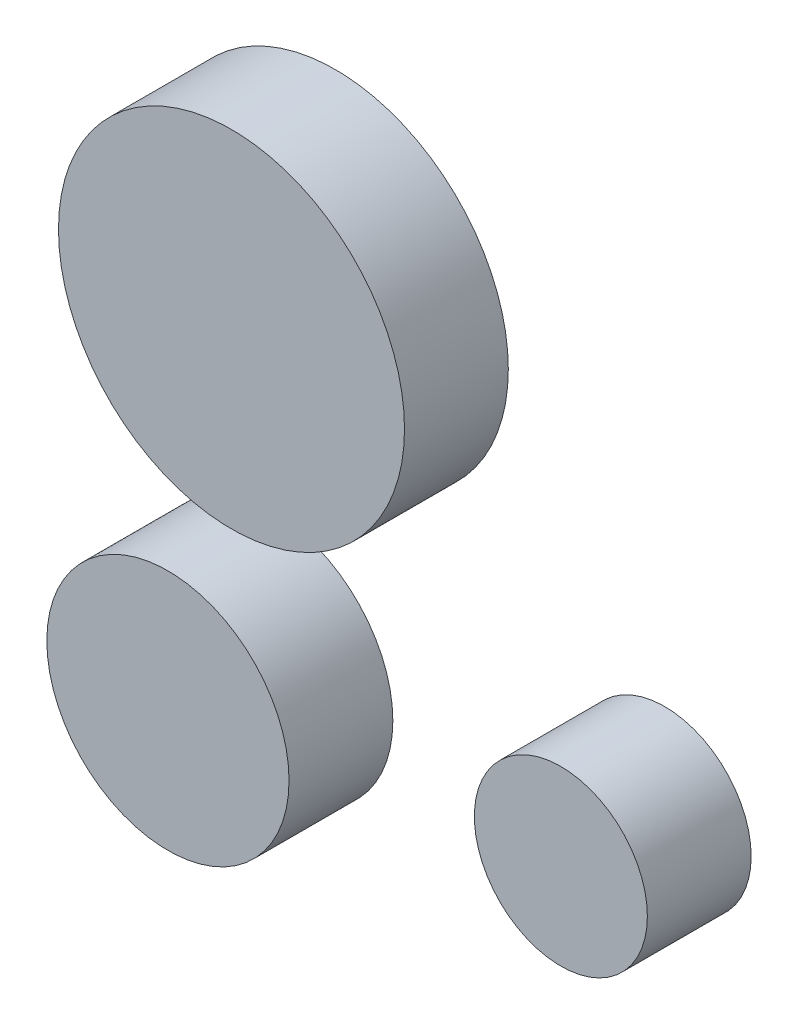
ISO-10303-21;
HEADER;
FILE_DESCRIPTION(('STEP AP214'),'2;1');
FILE_NAME('part.step','',(''),(''),'','','');
FILE_SCHEMA(('AUTOMOTIVE_DESIGN { 1 0 10303 214 1 1 1 1 }'));
ENDSEC;
DATA;
#1=APPLICATION_CONTEXT('core data for automotive mechanical design processes');
#2=APPLICATION_PROTOCOL_DEFINITION('international standard','automotive_design',2000,#1);
#3=PRODUCT_CONTEXT('',#1,'mechanical');
#4=PRODUCT('Part','Part','',(#3));
#5=PRODUCT_RELATED_PRODUCT_CATEGORY('part','',(#4));
#6=PRODUCT_DEFINITION_FORMATION('','',#4);
#7=PRODUCT_DEFINITION_CONTEXT('part definition',#1,'design');
#8=PRODUCT_DEFINITION('design','',#6,#7);
#9=PRODUCT_DEFINITION_SHAPE('','',#8);
#10=(LENGTH_UNIT() NAMED_UNIT(*) SI_UNIT(.MILLI.,.METRE.));
#11=(NAMED_UNIT(*) PLANE_ANGLE_UNIT() SI_UNIT($,.RADIAN.));
#12=(NAMED_UNIT(*) SI_UNIT($,.STERADIAN.) SOLID_ANGLE_UNIT());
#13=UNCERTAINTY_MEASURE_WITH_UNIT(LENGTH_MEASURE(1.E-05),#10,'distance_accuracy_value','');
#14=(GEOMETRIC_REPRESENTATION_CONTEXT(3) GLOBAL_UNCERTAINTY_ASSIGNED_CONTEXT((#13)) GLOBAL_UNIT_ASSIGNED_CONTEXT((#10,
#11,#12)) REPRESENTATION_CONTEXT('',''));
#15=CARTESIAN_POINT('',(0.,0.,0.));
#16=DIRECTION('',(0.,0.,1.));
#17=DIRECTION('',(1.,0.,0.));
#18=AXIS2_PLACEMENT_3D('',#15,#16,#17);
#19=CARTESIAN_POINT('',(-4.66560323146392,-26.5798002277339,7.62));
#20=DIRECTION('',(0.,0.,-1.));
#21=DIRECTION('',(-1.,0.,0.));
#22=AXIS2_PLACEMENT_3D('',#19,#20,#21);
#23=CYLINDRICAL_SURFACE('',#22,8.89);
#24=CARTESIAN_POINT('',(-4.66560323146392,-26.5798002277339,7.62));
#25=DIRECTION('',(0.,0.,1.));
#26=DIRECTION('',(1.,0.,0.));
#27=AXIS2_PLACEMENT_3D('',#24,#25,#26);
#28=CIRCLE('',#27,8.89);
#29=CARTESIAN_POINT('',(4.22439676853608,-26.5798002277339,7.62));
#30=VERTEX_POINT('',#29);
#31=EDGE_CURVE('E11',#30,#30,#28,.T.);
#32=ORIENTED_EDGE('',*,*,#31,.F.);
#33=EDGE_LOOP('',(#32));
#34=FACE_BOUND('',#33,.T.);
#35=CARTESIAN_POINT('',(-4.66560323146392,-26.5798002277339,0.));
#36=DIRECTION('',(0.,0.,1.));
#37=DIRECTION('',(1.,0.,0.));
#38=AXIS2_PLACEMENT_3D('',#35,#36,#37);
#39=CIRCLE('',#38,8.89);
#40=CARTESIAN_POINT('',(4.22439676853608,-26.5798002277339,0.));
#41=VERTEX_POINT('',#40);
#42=EDGE_CURVE('E47',#41,#41,#39,.T.);
#43=ORIENTED_EDGE('',*,*,#42,.T.);
#44=EDGE_LOOP('',(#43));
#45=FACE_BOUND('',#44,.T.);
#46=ADVANCED_FACE('F44',(#34,#45),#23,.T.);
#47=CARTESIAN_POINT('',(-4.66560323146392,-26.5798002277339,7.62));
#48=DIRECTION('',(0.,0.,1.));
#49=DIRECTION('',(1.,0.,0.));
#50=AXIS2_PLACEMENT_3D('',#47,#48,#49);
#51=PLANE('',#50);
#52=ORIENTED_EDGE('',*,*,#31,.T.);
#53=EDGE_LOOP('',(#52));
#54=FACE_BOUND('',#53,.T.);
#55=ADVANCED_FACE('F59',(#54),#51,.T.);
#56=CARTESIAN_POINT('',(-4.66560323146392,-26.5798002277339,0.));
#57=DIRECTION('',(0.,0.,1.));
#58=DIRECTION('',(1.,0.,0.));
#59=AXIS2_PLACEMENT_3D('',#56,#57,#58);
#60=PLANE('',#59);
#61=ORIENTED_EDGE('',*,*,#42,.F.);
#62=EDGE_LOOP('',(#61));
#63=FACE_BOUND('',#62,.T.);
#64=ADVANCED_FACE('F57',(#63),#60,.F.);
#65=CLOSED_SHELL('',(#46,#55,#64));
#66=MANIFOLD_SOLID_BREP('B2',#65);
#67=CARTESIAN_POINT('',(24.1763076539494,-22.0555789123749,7.62));
#68=DIRECTION('',(0.,0.,-1.));
#69=DIRECTION('',(-1.,0.,0.));
#70=AXIS2_PLACEMENT_3D('',#67,#68,#69);
#71=CYLINDRICAL_SURFACE('',#70,6.35);
#72=CARTESIAN_POINT('',(24.1763076539494,-22.0555789123749,7.62));
#73=DIRECTION('',(0.,0.,1.));
#74=DIRECTION('',(1.,0.,0.));
#75=AXIS2_PLACEMENT_3D('',#72,#73,#74);
#76=CIRCLE('',#75,6.35);
#77=CARTESIAN_POINT('',(30.5263076539494,-22.0555789123749,7.62));
#78=VERTEX_POINT('',#77);
#79=EDGE_CURVE('E43',#78,#78,#76,.T.);
#80=ORIENTED_EDGE('',*,*,#79,.F.);
#81=EDGE_LOOP('',(#80));
#82=FACE_BOUND('',#81,.T.);
#83=CARTESIAN_POINT('',(24.1763076539494,-22.0555789123749,0.));
#84=DIRECTION('',(0.,0.,1.));
#85=DIRECTION('',(1.,0.,0.));
#86=AXIS2_PLACEMENT_3D('',#83,#84,#85);
#87=CIRCLE('',#86,6.35);
#88=CARTESIAN_POINT('',(30.5263076539494,-22.0555789123749,0.));
#89=VERTEX_POINT('',#88);
#90=EDGE_CURVE('E95',#89,#89,#87,.T.);
#91=ORIENTED_EDGE('',*,*,#90,.T.);
#92=EDGE_LOOP('',(#91));
#93=FACE_BOUND('',#92,.T.);
#94=ADVANCED_FACE('F92',(#82,#93),#71,.T.);
#95=CARTESIAN_POINT('',(24.1763076539494,-22.0555789123749,7.62));
#96=DIRECTION('',(0.,0.,1.));
#97=DIRECTION('',(1.,0.,0.));
#98=AXIS2_PLACEMENT_3D('',#95,#96,#97);
#99=PLANE('',#98);
#100=ORIENTED_EDGE('',*,*,#79,.T.);
#101=EDGE_LOOP('',(#100));
#102=FACE_BOUND('',#101,.T.);
#103=ADVANCED_FACE('F107',(#102),#99,.T.);
#104=CARTESIAN_POINT('',(24.1763076539494,-22.0555789123749,0.));
#105=DIRECTION('',(0.,0.,1.));
#106=DIRECTION('',(1.,0.,0.));
#107=AXIS2_PLACEMENT_3D('',#104,#105,#106);
#108=PLANE('',#107);
#109=ORIENTED_EDGE('',*,*,#90,.F.);
#110=EDGE_LOOP('',(#109));
#111=FACE_BOUND('',#110,.T.);
#112=ADVANCED_FACE('F105',(#111),#108,.F.);
#113=CLOSED_SHELL('',(#94,#103,#112));
#114=MANIFOLD_SOLID_BREP('B6',#113);
#115=CARTESIAN_POINT('',(0.,0.,7.62));
#116=DIRECTION('',(0.,0.,-1.));
#117=DIRECTION('',(-1.,0.,0.));
#118=AXIS2_PLACEMENT_3D('',#115,#116,#117);
#119=CYLINDRICAL_SURFACE('',#118,12.7);
#120=CARTESIAN_POINT('',(0.,0.,7.62));
#121=DIRECTION('',(0.,0.,1.));
#122=DIRECTION('',(1.,0.,0.));
#123=AXIS2_PLACEMENT_3D('',#120,#121,#122);
#124=CIRCLE('',#123,12.7);
#125=CARTESIAN_POINT('',(12.7,0.,7.62));
#126=VERTEX_POINT('',#125);
#127=EDGE_CURVE('E91',#126,#126,#124,.T.);
#128=ORIENTED_EDGE('',*,*,#127,.F.);
#129=EDGE_LOOP('',(#128));
#130=FACE_BOUND('',#129,.T.);
#131=CARTESIAN_POINT('',(0.,0.,0.));
#132=DIRECTION('',(0.,0.,1.));
#133=DIRECTION('',(1.,0.,0.));
#134=AXIS2_PLACEMENT_3D('',#131,#132,#133);
#135=CIRCLE('',#134,12.7);
#136=CARTESIAN_POINT('',(12.7,0.,0.));
#137=VERTEX_POINT('',#136);
#138=EDGE_CURVE('E136',#137,#137,#135,.T.);
#139=ORIENTED_EDGE('',*,*,#138,.T.);
#140=EDGE_LOOP('',(#139));
#141=FACE_BOUND('',#140,.T.);
#142=ADVANCED_FACE('F133',(#130,#141),#119,.T.);
#143=CARTESIAN_POINT('',(0.,0.,7.62));
#144=DIRECTION('',(0.,0.,1.));
#145=DIRECTION('',(1.,0.,0.));
#146=AXIS2_PLACEMENT_3D('',#143,#144,#145);
#147=PLANE('',#146);
#148=ORIENTED_EDGE('',*,*,#127,.T.);
#149=EDGE_LOOP('',(#148));
#150=FACE_BOUND('',#149,.T.);
#151=ADVANCED_FACE('F148',(#150),#147,.T.);
#152=CARTESIAN_POINT('',(0.,0.,0.));
#153=DIRECTION('',(0.,0.,1.));
#154=DIRECTION('',(1.,0.,0.));
#155=AXIS2_PLACEMENT_3D('',#152,#153,#154);
#156=PLANE('',#155);
#157=ORIENTED_EDGE('',*,*,#138,.F.);
#158=EDGE_LOOP('',(#157));
#159=FACE_BOUND('',#158,.T.);
#160=ADVANCED_FACE('F146',(#159),#156,.F.);
#161=CLOSED_SHELL('',(#142,#151,#160));
#162=MANIFOLD_SOLID_BREP('B38',#161);
#163=ADVANCED_BREP_SHAPE_REPRESENTATION('',(#18,#66,#114,#162),#14);
#164=SHAPE_DEFINITION_REPRESENTATION(#9,#163);
ENDSEC;
END-ISO-10303-21;
